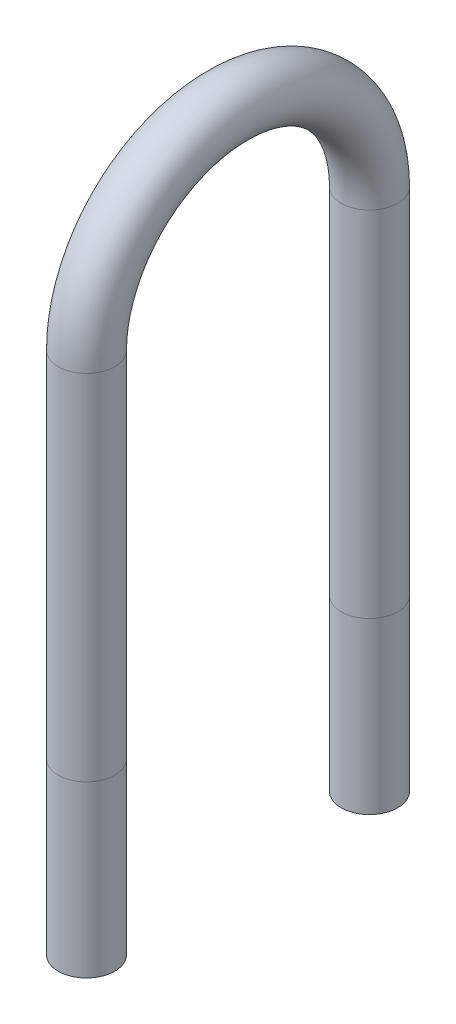
ISO-10303-21;
HEADER;
FILE_DESCRIPTION(('STEP AP214'),'2;1');
FILE_NAME('part.step','',(''),(''),'','','');
FILE_SCHEMA(('AUTOMOTIVE_DESIGN { 1 0 10303 214 1 1 1 1 }'));
ENDSEC;
DATA;
#1=APPLICATION_CONTEXT('core data for automotive mechanical design processes');
#2=APPLICATION_PROTOCOL_DEFINITION('international standard','automotive_design',2000,#1);
#3=PRODUCT_CONTEXT('',#1,'mechanical');
#4=PRODUCT('Part','Part','',(#3));
#5=PRODUCT_RELATED_PRODUCT_CATEGORY('part','',(#4));
#6=PRODUCT_DEFINITION_FORMATION('','',#4);
#7=PRODUCT_DEFINITION_CONTEXT('part definition',#1,'design');
#8=PRODUCT_DEFINITION('design','',#6,#7);
#9=PRODUCT_DEFINITION_SHAPE('','',#8);
#10=(LENGTH_UNIT() NAMED_UNIT(*) SI_UNIT(.MILLI.,.METRE.));
#11=(NAMED_UNIT(*) PLANE_ANGLE_UNIT() SI_UNIT($,.RADIAN.));
#12=(NAMED_UNIT(*) SI_UNIT($,.STERADIAN.) SOLID_ANGLE_UNIT());
#13=UNCERTAINTY_MEASURE_WITH_UNIT(LENGTH_MEASURE(1.E-05),#10,'distance_accuracy_value','');
#14=(GEOMETRIC_REPRESENTATION_CONTEXT(3) GLOBAL_UNCERTAINTY_ASSIGNED_CONTEXT((#13)) GLOBAL_UNIT_ASSIGNED_CONTEXT((#10,
#11,#12)) REPRESENTATION_CONTEXT('',''));
#15=CARTESIAN_POINT('',(0.,0.,0.));
#16=DIRECTION('',(0.,0.,1.));
#17=DIRECTION('',(1.,0.,0.));
#18=AXIS2_PLACEMENT_3D('',#15,#16,#17);
#19=CARTESIAN_POINT('',(0.,-152.4,-254.));
#20=DIRECTION('',(0.,1.,0.));
#21=DIRECTION('',(0.,0.,1.));
#22=AXIS2_PLACEMENT_3D('',#19,#20,#21);
#23=CYLINDRICAL_SURFACE('',#22,25.4);
#24=CARTESIAN_POINT('',(0.,0.,-254.));
#25=DIRECTION('',(0.,-1.,0.));
#26=DIRECTION('',(0.,0.,-1.));
#27=AXIS2_PLACEMENT_3D('',#24,#25,#26);
#28=CIRCLE('',#27,25.4);
#29=CARTESIAN_POINT('',(0.,0.,-279.4));
#30=VERTEX_POINT('',#29);
#31=EDGE_CURVE('E58',#30,#30,#28,.T.);
#32=ORIENTED_EDGE('',*,*,#31,.T.);
#33=EDGE_LOOP('',(#32));
#34=FACE_BOUND('',#33,.T.);
#35=CARTESIAN_POINT('',(0.,-152.4,-254.));
#36=DIRECTION('',(0.,-1.,0.));
#37=DIRECTION('',(0.,0.,-1.));
#38=AXIS2_PLACEMENT_3D('',#35,#36,#37);
#39=CIRCLE('',#38,25.4);
#40=CARTESIAN_POINT('',(0.,-152.4,-279.4));
#41=VERTEX_POINT('',#40);
#42=EDGE_CURVE('E55',#41,#41,#39,.T.);
#43=ORIENTED_EDGE('',*,*,#42,.F.);
#44=EDGE_LOOP('',(#43));
#45=FACE_BOUND('',#44,.T.);
#46=ADVANCED_FACE('F34',(#34,#45),#23,.T.);
#47=CARTESIAN_POINT('',(0.,0.,-254.));
#48=DIRECTION('',(0.,1.,0.));
#49=DIRECTION('',(0.,0.,1.));
#50=AXIS2_PLACEMENT_3D('',#47,#48,#49);
#51=CYLINDRICAL_SURFACE('',#50,25.4);
#52=CARTESIAN_POINT('',(0.,317.5,-254.));
#53=DIRECTION('',(0.,-1.,0.));
#54=DIRECTION('',(0.,0.,-1.));
#55=AXIS2_PLACEMENT_3D('',#52,#53,#54);
#56=CIRCLE('',#55,25.4);
#57=CARTESIAN_POINT('',(0.,317.5,-279.4));
#58=VERTEX_POINT('',#57);
#59=EDGE_CURVE('E61',#58,#58,#56,.T.);
#60=ORIENTED_EDGE('',*,*,#59,.T.);
#61=EDGE_LOOP('',(#60));
#62=FACE_BOUND('',#61,.T.);
#63=ORIENTED_EDGE('',*,*,#31,.F.);
#64=EDGE_LOOP('',(#63));
#65=FACE_BOUND('',#64,.T.);
#66=ADVANCED_FACE('F103',(#62,#65),#51,.T.);
#67=CARTESIAN_POINT('',(0.,317.5,-127.));
#68=DIRECTION('',(1.,0.,0.));
#69=DIRECTION('',(0.,0.,-1.));
#70=AXIS2_PLACEMENT_3D('',#67,#68,#69);
#71=TOROIDAL_SURFACE('',#70,127.,25.4);
#72=CARTESIAN_POINT('',(0.,317.5,0.));
#73=DIRECTION('',(0.,1.,0.));
#74=DIRECTION('',(0.,0.,1.));
#75=AXIS2_PLACEMENT_3D('',#72,#73,#74);
#76=CIRCLE('',#75,25.4);
#77=CARTESIAN_POINT('',(0.,317.5,25.4));
#78=VERTEX_POINT('',#77);
#79=EDGE_CURVE('E63',#78,#78,#76,.T.);
#80=CARTESIAN_POINT('',(0.,317.5,-127.));
#81=DIRECTION('',(1.,0.,0.));
#82=DIRECTION('',(0.,0.,-1.));
#83=AXIS2_PLACEMENT_3D('',#80,#81,#82);
#84=CIRCLE('',#83,152.4);
#85=EDGE_CURVE('',#58,#78,#84,.T.);
#86=ORIENTED_EDGE('',*,*,#59,.F.);
#87=ORIENTED_EDGE('',*,*,#79,.T.);
#88=ORIENTED_EDGE('',*,*,#85,.T.);
#89=ORIENTED_EDGE('',*,*,#85,.F.);
#90=EDGE_LOOP('',(#86,#88,#87,#89));
#91=FACE_BOUND('',#90,.T.);
#92=ADVANCED_FACE('F83',(#91),#71,.T.);
#93=CARTESIAN_POINT('',(0.,317.5,0.));
#94=DIRECTION('',(0.,-1.,0.));
#95=DIRECTION('',(0.,0.,-1.));
#96=AXIS2_PLACEMENT_3D('',#93,#94,#95);
#97=CYLINDRICAL_SURFACE('',#96,25.4);
#98=CARTESIAN_POINT('',(0.,0.,0.));
#99=DIRECTION('',(0.,1.,0.));
#100=DIRECTION('',(0.,0.,1.));
#101=AXIS2_PLACEMENT_3D('',#98,#99,#100);
#102=CIRCLE('',#101,25.4);
#103=CARTESIAN_POINT('',(0.,0.,25.4));
#104=VERTEX_POINT('',#103);
#105=EDGE_CURVE('E38',#104,#104,#102,.T.);
#106=ORIENTED_EDGE('',*,*,#105,.T.);
#107=EDGE_LOOP('',(#106));
#108=FACE_BOUND('',#107,.T.);
#109=ORIENTED_EDGE('',*,*,#79,.F.);
#110=EDGE_LOOP('',(#109));
#111=FACE_BOUND('',#110,.T.);
#112=ADVANCED_FACE('F70',(#108,#111),#97,.T.);
#113=CARTESIAN_POINT('',(0.,0.,0.));
#114=DIRECTION('',(0.,-1.,0.));
#115=DIRECTION('',(0.,0.,-1.));
#116=AXIS2_PLACEMENT_3D('',#113,#114,#115);
#117=CYLINDRICAL_SURFACE('',#116,25.4);
#118=CARTESIAN_POINT('',(0.,-152.4,0.));
#119=DIRECTION('',(0.,1.,0.));
#120=DIRECTION('',(0.,0.,1.));
#121=AXIS2_PLACEMENT_3D('',#118,#119,#120);
#122=CIRCLE('',#121,25.4);
#123=CARTESIAN_POINT('',(0.,-152.4,25.4));
#124=VERTEX_POINT('',#123);
#125=EDGE_CURVE('E51',#124,#124,#122,.T.);
#126=ORIENTED_EDGE('',*,*,#125,.T.);
#127=EDGE_LOOP('',(#126));
#128=FACE_BOUND('',#127,.T.);
#129=ORIENTED_EDGE('',*,*,#105,.F.);
#130=EDGE_LOOP('',(#129));
#131=FACE_BOUND('',#130,.T.);
#132=ADVANCED_FACE('F36',(#128,#131),#117,.T.);
#133=CARTESIAN_POINT('',(0.,-152.4,-254.));
#134=DIRECTION('',(0.,-1.,0.));
#135=DIRECTION('',(0.,0.,-1.));
#136=AXIS2_PLACEMENT_3D('',#133,#134,#135);
#137=PLANE('',#136);
#138=CARTESIAN_POINT('',(0.,-152.4,-254.));
#139=DIRECTION('',(0.,-1.,0.));
#140=DIRECTION('',(0.,0.,-1.));
#141=AXIS2_PLACEMENT_3D('',#138,#139,#140);
#142=CIRCLE('',#141,23.749);
#143=CARTESIAN_POINT('',(0.,-152.4,-277.749));
#144=VERTEX_POINT('',#143);
#145=EDGE_CURVE('E54',#144,#144,#142,.F.);
#146=ORIENTED_EDGE('',*,*,#145,.T.);
#147=EDGE_LOOP('',(#146));
#148=FACE_BOUND('',#147,.T.);
#149=ORIENTED_EDGE('',*,*,#42,.T.);
#150=EDGE_LOOP('',(#149));
#151=FACE_BOUND('',#150,.T.);
#152=ADVANCED_FACE('F74',(#148,#151),#137,.T.);
#153=CARTESIAN_POINT('',(0.,-152.4,0.));
#154=DIRECTION('',(0.,1.,0.));
#155=DIRECTION('',(0.,0.,1.));
#156=AXIS2_PLACEMENT_3D('',#153,#154,#155);
#157=PLANE('',#156);
#158=CARTESIAN_POINT('',(0.,-152.4,0.));
#159=DIRECTION('',(0.,1.,0.));
#160=DIRECTION('',(0.,0.,1.));
#161=AXIS2_PLACEMENT_3D('',#158,#159,#160);
#162=CIRCLE('',#161,23.749);
#163=CARTESIAN_POINT('',(0.,-152.4,23.749));
#164=VERTEX_POINT('',#163);
#165=EDGE_CURVE('E10',#164,#164,#162,.F.);
#166=ORIENTED_EDGE('',*,*,#165,.F.);
#167=EDGE_LOOP('',(#166));
#168=FACE_BOUND('',#167,.T.);
#169=ORIENTED_EDGE('',*,*,#125,.F.);
#170=EDGE_LOOP('',(#169));
#171=FACE_BOUND('',#170,.T.);
#172=ADVANCED_FACE('F80',(#168,#171),#157,.F.);
#173=CARTESIAN_POINT('',(0.,-152.4,-254.));
#174=DIRECTION('',(0.,1.,0.));
#175=DIRECTION('',(0.,0.,1.));
#176=AXIS2_PLACEMENT_3D('',#173,#174,#175);
#177=CYLINDRICAL_SURFACE('',#176,23.749);
#178=CARTESIAN_POINT('',(0.,0.,-254.));
#179=DIRECTION('',(0.,-1.,0.));
#180=DIRECTION('',(0.,0.,-1.));
#181=AXIS2_PLACEMENT_3D('',#178,#179,#180);
#182=CIRCLE('',#181,23.749);
#183=CARTESIAN_POINT('',(0.,0.,-277.749));
#184=VERTEX_POINT('',#183);
#185=EDGE_CURVE('E187',#184,#184,#182,.F.);
#186=ORIENTED_EDGE('',*,*,#185,.T.);
#187=EDGE_LOOP('',(#186));
#188=FACE_BOUND('',#187,.T.);
#189=ORIENTED_EDGE('',*,*,#145,.F.);
#190=EDGE_LOOP('',(#189));
#191=FACE_BOUND('',#190,.T.);
#192=ADVANCED_FACE('F98',(#188,#191),#177,.F.);
#193=CARTESIAN_POINT('',(0.,0.,-254.));
#194=DIRECTION('',(0.,1.,0.));
#195=DIRECTION('',(0.,0.,1.));
#196=AXIS2_PLACEMENT_3D('',#193,#194,#195);
#197=CYLINDRICAL_SURFACE('',#196,23.749);
#198=CARTESIAN_POINT('',(0.,317.5,-254.));
#199=DIRECTION('',(0.,-1.,0.));
#200=DIRECTION('',(0.,0.,-1.));
#201=AXIS2_PLACEMENT_3D('',#198,#199,#200);
#202=CIRCLE('',#201,23.749);
#203=CARTESIAN_POINT('',(0.,317.5,-277.749));
#204=VERTEX_POINT('',#203);
#205=EDGE_CURVE('E186',#204,#204,#202,.F.);
#206=ORIENTED_EDGE('',*,*,#205,.T.);
#207=EDGE_LOOP('',(#206));
#208=FACE_BOUND('',#207,.T.);
#209=ORIENTED_EDGE('',*,*,#185,.F.);
#210=EDGE_LOOP('',(#209));
#211=FACE_BOUND('',#210,.T.);
#212=ADVANCED_FACE('F149',(#208,#211),#197,.F.);
#213=CARTESIAN_POINT('',(0.,317.5,-127.));
#214=DIRECTION('',(1.,0.,0.));
#215=DIRECTION('',(0.,0.,-1.));
#216=AXIS2_PLACEMENT_3D('',#213,#214,#215);
#217=TOROIDAL_SURFACE('',#216,127.,23.749);
#218=CARTESIAN_POINT('',(0.,317.5,0.));
#219=DIRECTION('',(0.,1.,0.));
#220=DIRECTION('',(0.,0.,1.));
#221=AXIS2_PLACEMENT_3D('',#218,#219,#220);
#222=CIRCLE('',#221,23.749);
#223=CARTESIAN_POINT('',(0.,317.5,23.749));
#224=VERTEX_POINT('',#223);
#225=EDGE_CURVE('E47',#224,#224,#222,.F.);
#226=CARTESIAN_POINT('',(0.,317.5,-127.));
#227=DIRECTION('',(1.,0.,0.));
#228=DIRECTION('',(0.,0.,-1.));
#229=AXIS2_PLACEMENT_3D('',#226,#227,#228);
#230=CIRCLE('',#229,150.749);
#231=EDGE_CURVE('',#204,#224,#230,.T.);
#232=ORIENTED_EDGE('',*,*,#205,.F.);
#233=ORIENTED_EDGE('',*,*,#225,.T.);
#234=ORIENTED_EDGE('',*,*,#231,.T.);
#235=ORIENTED_EDGE('',*,*,#231,.F.);
#236=EDGE_LOOP('',(#232,#234,#233,#235));
#237=FACE_BOUND('',#236,.T.);
#238=ADVANCED_FACE('F91',(#237),#217,.F.);
#239=CARTESIAN_POINT('',(0.,317.5,0.));
#240=DIRECTION('',(0.,-1.,0.));
#241=DIRECTION('',(0.,0.,-1.));
#242=AXIS2_PLACEMENT_3D('',#239,#240,#241);
#243=CYLINDRICAL_SURFACE('',#242,23.749);
#244=CARTESIAN_POINT('',(0.,0.,0.));
#245=DIRECTION('',(0.,1.,0.));
#246=DIRECTION('',(0.,0.,1.));
#247=AXIS2_PLACEMENT_3D('',#244,#245,#246);
#248=CIRCLE('',#247,23.749);
#249=CARTESIAN_POINT('',(0.,0.,23.749));
#250=VERTEX_POINT('',#249);
#251=EDGE_CURVE('E42',#250,#250,#248,.F.);
#252=ORIENTED_EDGE('',*,*,#251,.T.);
#253=EDGE_LOOP('',(#252));
#254=FACE_BOUND('',#253,.T.);
#255=ORIENTED_EDGE('',*,*,#225,.F.);
#256=EDGE_LOOP('',(#255));
#257=FACE_BOUND('',#256,.T.);
#258=ADVANCED_FACE('F86',(#254,#257),#243,.F.);
#259=CARTESIAN_POINT('',(0.,0.,0.));
#260=DIRECTION('',(0.,-1.,0.));
#261=DIRECTION('',(0.,0.,-1.));
#262=AXIS2_PLACEMENT_3D('',#259,#260,#261);
#263=CYLINDRICAL_SURFACE('',#262,23.749);
#264=ORIENTED_EDGE('',*,*,#165,.T.);
#265=EDGE_LOOP('',(#264));
#266=FACE_BOUND('',#265,.T.);
#267=ORIENTED_EDGE('',*,*,#251,.F.);
#268=EDGE_LOOP('',(#267));
#269=FACE_BOUND('',#268,.T.);
#270=ADVANCED_FACE('F84',(#266,#269),#263,.F.);
#271=CLOSED_SHELL('',(#46,#66,#92,#112,#132,#152,#172,#192,#212,#238,#258,#270));
#272=MANIFOLD_SOLID_BREP('B2',#271);
#273=ADVANCED_BREP_SHAPE_REPRESENTATION('',(#18,#272),#14);
#274=SHAPE_DEFINITION_REPRESENTATION(#9,#273);
ENDSEC;
END-ISO-10303-21;
